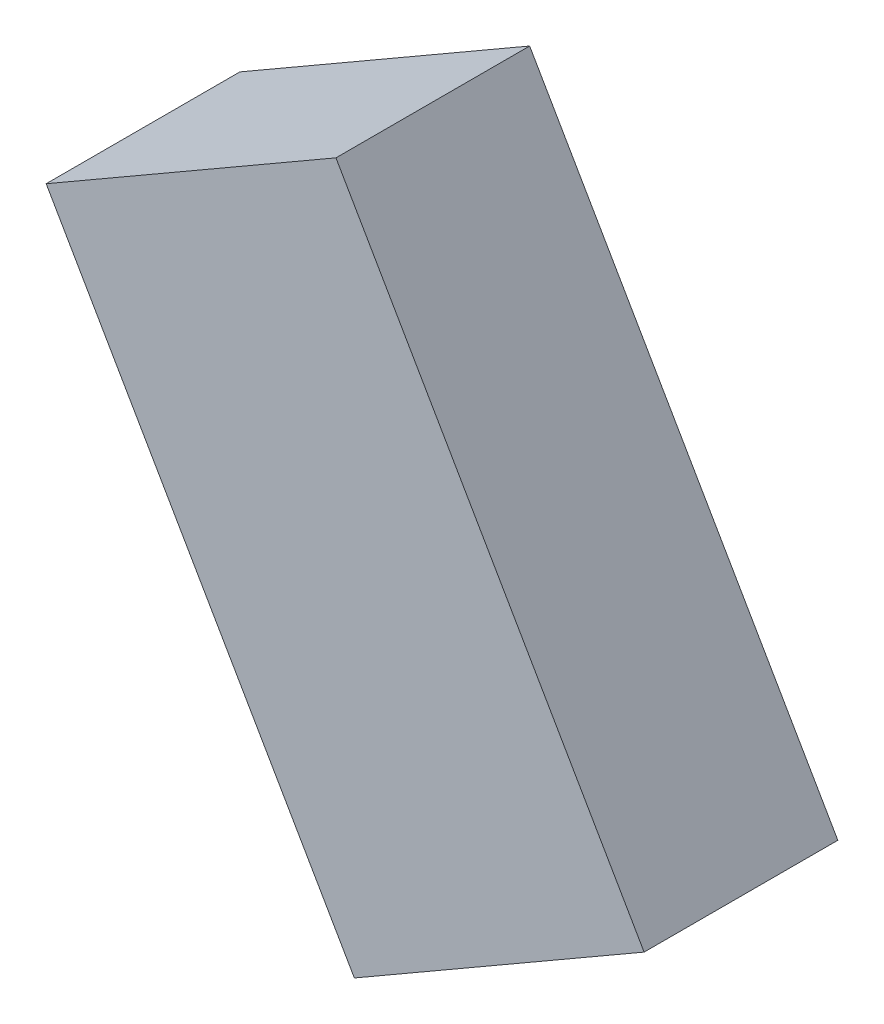
ISO-10303-21;
HEADER;
FILE_DESCRIPTION(('STEP AP214'),'2;1');
FILE_NAME('part.step','',(''),(''),'','','');
FILE_SCHEMA(('AUTOMOTIVE_DESIGN { 1 0 10303 214 1 1 1 1 }'));
ENDSEC;
DATA;
#1=APPLICATION_CONTEXT('core data for automotive mechanical design processes');
#2=APPLICATION_PROTOCOL_DEFINITION('international standard','automotive_design',2000,#1);
#3=PRODUCT_CONTEXT('',#1,'mechanical');
#4=PRODUCT('Part','Part','',(#3));
#5=PRODUCT_RELATED_PRODUCT_CATEGORY('part','',(#4));
#6=PRODUCT_DEFINITION_FORMATION('','',#4);
#7=PRODUCT_DEFINITION_CONTEXT('part definition',#1,'design');
#8=PRODUCT_DEFINITION('design','',#6,#7);
#9=PRODUCT_DEFINITION_SHAPE('','',#8);
#10=(LENGTH_UNIT() NAMED_UNIT(*) SI_UNIT(.MILLI.,.METRE.));
#11=(NAMED_UNIT(*) PLANE_ANGLE_UNIT() SI_UNIT($,.RADIAN.));
#12=(NAMED_UNIT(*) SI_UNIT($,.STERADIAN.) SOLID_ANGLE_UNIT());
#13=UNCERTAINTY_MEASURE_WITH_UNIT(LENGTH_MEASURE(1.E-05),#10,'distance_accuracy_value','');
#14=(GEOMETRIC_REPRESENTATION_CONTEXT(3) GLOBAL_UNCERTAINTY_ASSIGNED_CONTEXT((#13)) GLOBAL_UNIT_ASSIGNED_CONTEXT((#10,
#11,#12)) REPRESENTATION_CONTEXT('',''));
#15=CARTESIAN_POINT('',(0.,0.,0.));
#16=DIRECTION('',(0.,0.,1.));
#17=DIRECTION('',(1.,0.,0.));
#18=AXIS2_PLACEMENT_3D('',#15,#16,#17);
#19=CARTESIAN_POINT('',(0.84886292,-0.52027074,0.5499989));
#20=DIRECTION('',(0.,0.,-1.));
#21=DIRECTION('',(-1.,0.,0.));
#22=AXIS2_PLACEMENT_3D('',#19,#20,#21);
#23=PLANE('',#22);
#24=DIRECTION('',(0.86602583329618,0.499999256063104,0.));
#25=VECTOR('',#24,1.);
#26=CARTESIAN_POINT('',(-0.0261366,0.99527106,0.5499989));
#27=LINE('',#26,#25);
#28=CARTESIAN_POINT('',(-0.0261365999999377,0.995271060000036,0.5499989));
#29=VERTEX_POINT('',#28);
#30=CARTESIAN_POINT('',(-0.848862920000052,0.52027074000009,0.5499989));
#31=VERTEX_POINT('',#30);
#32=EDGE_CURVE('E54',#29,#31,#27,.F.);
#33=ORIENTED_EDGE('',*,*,#32,.T.);
#34=DIRECTION('',(-0.500000451629818,0.866025143035685,0.));
#35=VECTOR('',#34,1.);
#36=CARTESIAN_POINT('',(-0.84886292,0.52027074,0.5499989));
#37=LINE('',#36,#35);
#38=CARTESIAN_POINT('',(0.0261365999999377,-0.995271060000036,0.5499989));
#39=VERTEX_POINT('',#38);
#40=EDGE_CURVE('E56',#31,#39,#37,.F.);
#41=ORIENTED_EDGE('',*,*,#40,.T.);
#42=DIRECTION('',(-0.86602583329618,-0.499999256063104,0.));
#43=VECTOR('',#42,1.);
#44=CARTESIAN_POINT('',(0.0261366,-0.99527106,0.5499989));
#45=LINE('',#44,#43);
#46=CARTESIAN_POINT('',(0.848862920000104,-0.520270740000181,0.5499989));
#47=VERTEX_POINT('',#46);
#48=EDGE_CURVE('E19',#39,#47,#45,.F.);
#49=ORIENTED_EDGE('',*,*,#48,.T.);
#50=DIRECTION('',(0.500000451629818,-0.866025143035685,0.));
#51=VECTOR('',#50,1.);
#52=CARTESIAN_POINT('',(0.84886292,-0.52027074,0.5499989));
#53=LINE('',#52,#51);
#54=EDGE_CURVE('E79',#47,#29,#53,.F.);
#55=ORIENTED_EDGE('',*,*,#54,.T.);
#56=EDGE_LOOP('',(#33,#41,#49,#55));
#57=FACE_BOUND('',#56,.T.);
#58=ADVANCED_FACE('F16',(#57),#23,.F.);
#59=CARTESIAN_POINT('',(0.0261366,-0.99527106,0.));
#60=DIRECTION('',(-0.499999256063104,0.86602583329618,0.));
#61=DIRECTION('',(-0.86602583329618,-0.499999256063104,0.));
#62=AXIS2_PLACEMENT_3D('',#59,#60,#61);
#63=PLANE('',#62);
#64=DIRECTION('',(0.,0.,1.));
#65=VECTOR('',#64,1.);
#66=CARTESIAN_POINT('',(0.84886292,-0.52027074,0.));
#67=LINE('',#66,#65);
#68=CARTESIAN_POINT('',(0.848862920000104,-0.520270740000181,0.));
#69=VERTEX_POINT('',#68);
#70=EDGE_CURVE('E67',#69,#47,#67,.T.);
#71=ORIENTED_EDGE('',*,*,#70,.T.);
#72=ORIENTED_EDGE('',*,*,#48,.F.);
#73=DIRECTION('',(0.,0.,1.));
#74=VECTOR('',#73,1.);
#75=CARTESIAN_POINT('',(0.0261365999997507,-0.995271060000145,0.));
#76=LINE('',#75,#74);
#77=CARTESIAN_POINT('',(0.0261365999999377,-0.995271060000036,0.));
#78=VERTEX_POINT('',#77);
#79=EDGE_CURVE('E62',#39,#78,#76,.F.);
#80=ORIENTED_EDGE('',*,*,#79,.T.);
#81=DIRECTION('',(-0.86602583329596,-0.499999256063484,0.));
#82=VECTOR('',#81,1.);
#83=CARTESIAN_POINT('',(0.84886292,-0.52027074,0.));
#84=LINE('',#83,#82);
#85=EDGE_CURVE('E82',#69,#78,#84,.T.);
#86=ORIENTED_EDGE('',*,*,#85,.F.);
#87=EDGE_LOOP('',(#71,#72,#80,#86));
#88=FACE_BOUND('',#87,.T.);
#89=ADVANCED_FACE('F64',(#88),#63,.F.);
#90=CARTESIAN_POINT('',(-0.84886292,0.52027074,0.));
#91=DIRECTION('',(0.866025143035685,0.500000451629818,0.));
#92=DIRECTION('',(-0.500000451629818,0.866025143035685,0.));
#93=AXIS2_PLACEMENT_3D('',#90,#91,#92);
#94=PLANE('',#93);
#95=ORIENTED_EDGE('',*,*,#79,.F.);
#96=ORIENTED_EDGE('',*,*,#40,.F.);
#97=DIRECTION('',(0.,0.,1.));
#98=VECTOR('',#97,1.);
#99=CARTESIAN_POINT('',(-0.848862920000208,0.520270740000361,0.));
#100=LINE('',#99,#98);
#101=CARTESIAN_POINT('',(-0.848862920000052,0.52027074000009,0.));
#102=VERTEX_POINT('',#101);
#103=EDGE_CURVE('E74',#31,#102,#100,.F.);
#104=ORIENTED_EDGE('',*,*,#103,.T.);
#105=DIRECTION('',(-0.500000451629961,0.866025143035602,0.));
#106=VECTOR('',#105,1.);
#107=CARTESIAN_POINT('',(0.0261366000000001,-0.99527106,0.));
#108=LINE('',#107,#106);
#109=EDGE_CURVE('E71',#78,#102,#108,.T.);
#110=ORIENTED_EDGE('',*,*,#109,.F.);
#111=EDGE_LOOP('',(#95,#96,#104,#110));
#112=FACE_BOUND('',#111,.T.);
#113=ADVANCED_FACE('F69',(#112),#94,.F.);
#114=CARTESIAN_POINT('',(-0.0261366,0.99527106,0.));
#115=DIRECTION('',(0.499999256063104,-0.86602583329618,0.));
#116=DIRECTION('',(0.86602583329618,0.499999256063104,0.));
#117=AXIS2_PLACEMENT_3D('',#114,#115,#116);
#118=PLANE('',#117);
#119=ORIENTED_EDGE('',*,*,#103,.F.);
#120=ORIENTED_EDGE('',*,*,#32,.F.);
#121=DIRECTION('',(0.,0.,1.));
#122=VECTOR('',#121,1.);
#123=CARTESIAN_POINT('',(-0.0261365999997507,0.995271060000145,0.));
#124=LINE('',#123,#122);
#125=CARTESIAN_POINT('',(-0.0261365999999377,0.995271060000036,0.));
#126=VERTEX_POINT('',#125);
#127=EDGE_CURVE('E34',#29,#126,#124,.F.);
#128=ORIENTED_EDGE('',*,*,#127,.T.);
#129=DIRECTION('',(0.86602583329596,0.499999256063484,0.));
#130=VECTOR('',#129,1.);
#131=CARTESIAN_POINT('',(-0.84886292,0.52027074,0.));
#132=LINE('',#131,#130);
#133=EDGE_CURVE('E25',#102,#126,#132,.T.);
#134=ORIENTED_EDGE('',*,*,#133,.F.);
#135=EDGE_LOOP('',(#119,#120,#128,#134));
#136=FACE_BOUND('',#135,.T.);
#137=ADVANCED_FACE('F88',(#136),#118,.F.);
#138=CARTESIAN_POINT('',(0.84886292,-0.52027074,0.));
#139=DIRECTION('',(-0.866025143035685,-0.500000451629818,0.));
#140=DIRECTION('',(0.500000451629818,-0.866025143035685,0.));
#141=AXIS2_PLACEMENT_3D('',#138,#139,#140);
#142=PLANE('',#141);
#143=ORIENTED_EDGE('',*,*,#127,.F.);
#144=ORIENTED_EDGE('',*,*,#54,.F.);
#145=ORIENTED_EDGE('',*,*,#70,.F.);
#146=DIRECTION('',(0.500000451629961,-0.866025143035602,0.));
#147=VECTOR('',#146,1.);
#148=CARTESIAN_POINT('',(-0.0261366000000001,0.99527106,0.));
#149=LINE('',#148,#147);
#150=EDGE_CURVE('E11',#126,#69,#149,.T.);
#151=ORIENTED_EDGE('',*,*,#150,.F.);
#152=EDGE_LOOP('',(#143,#144,#145,#151));
#153=FACE_BOUND('',#152,.T.);
#154=ADVANCED_FACE('F90',(#153),#142,.F.);
#155=CARTESIAN_POINT('',(0.84886292,-0.52027074,0.));
#156=DIRECTION('',(0.,0.,-1.));
#157=DIRECTION('',(-1.,0.,0.));
#158=AXIS2_PLACEMENT_3D('',#155,#156,#157);
#159=PLANE('',#158);
#160=ORIENTED_EDGE('',*,*,#133,.T.);
#161=ORIENTED_EDGE('',*,*,#150,.T.);
#162=ORIENTED_EDGE('',*,*,#85,.T.);
#163=ORIENTED_EDGE('',*,*,#109,.T.);
#164=EDGE_LOOP('',(#160,#161,#162,#163));
#165=FACE_BOUND('',#164,.T.);
#166=ADVANCED_FACE('F87',(#165),#159,.T.);
#167=CLOSED_SHELL('',(#58,#89,#113,#137,#154,#166));
#168=MANIFOLD_SOLID_BREP('B1',#167);
#169=ADVANCED_BREP_SHAPE_REPRESENTATION('',(#18,#168),#14);
#170=SHAPE_DEFINITION_REPRESENTATION(#9,#169);
ENDSEC;
END-ISO-10303-21;
